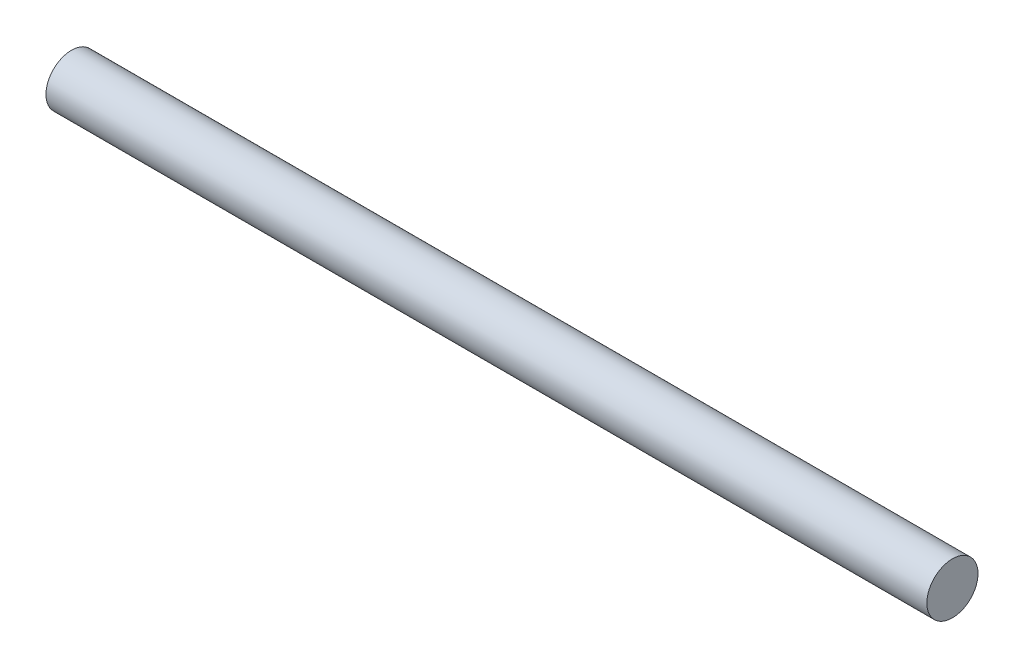
ISO-10303-21;
HEADER;
FILE_DESCRIPTION(('STEP AP214'),'2;1');
FILE_NAME('part.step','',(''),(''),'','','');
FILE_SCHEMA(('AUTOMOTIVE_DESIGN { 1 0 10303 214 1 1 1 1 }'));
ENDSEC;
DATA;
#1=APPLICATION_CONTEXT('core data for automotive mechanical design processes');
#2=APPLICATION_PROTOCOL_DEFINITION('international standard','automotive_design',2000,#1);
#3=PRODUCT_CONTEXT('',#1,'mechanical');
#4=PRODUCT('Part','Part','',(#3));
#5=PRODUCT_RELATED_PRODUCT_CATEGORY('part','',(#4));
#6=PRODUCT_DEFINITION_FORMATION('','',#4);
#7=PRODUCT_DEFINITION_CONTEXT('part definition',#1,'design');
#8=PRODUCT_DEFINITION('design','',#6,#7);
#9=PRODUCT_DEFINITION_SHAPE('','',#8);
#10=(LENGTH_UNIT() NAMED_UNIT(*) SI_UNIT(.MILLI.,.METRE.));
#11=(NAMED_UNIT(*) PLANE_ANGLE_UNIT() SI_UNIT($,.RADIAN.));
#12=(NAMED_UNIT(*) SI_UNIT($,.STERADIAN.) SOLID_ANGLE_UNIT());
#13=UNCERTAINTY_MEASURE_WITH_UNIT(LENGTH_MEASURE(1.E-05),#10,'distance_accuracy_value','');
#14=(GEOMETRIC_REPRESENTATION_CONTEXT(3) GLOBAL_UNCERTAINTY_ASSIGNED_CONTEXT((#13)) GLOBAL_UNIT_ASSIGNED_CONTEXT((#10,
#11,#12)) REPRESENTATION_CONTEXT('',''));
#15=CARTESIAN_POINT('',(0.,0.,0.));
#16=DIRECTION('',(0.,0.,1.));
#17=DIRECTION('',(1.,0.,0.));
#18=AXIS2_PLACEMENT_3D('',#15,#16,#17);
#19=CARTESIAN_POINT('',(620.,0.,0.));
#20=DIRECTION('',(-1.,0.,0.));
#21=DIRECTION('',(0.,0.,1.));
#22=AXIS2_PLACEMENT_3D('',#19,#20,#21);
#23=CYLINDRICAL_SURFACE('',#22,18.);
#24=CARTESIAN_POINT('',(620.,0.,0.));
#25=DIRECTION('',(1.,0.,0.));
#26=DIRECTION('',(0.,0.,-1.));
#27=AXIS2_PLACEMENT_3D('',#24,#25,#26);
#28=CIRCLE('',#27,18.);
#29=CARTESIAN_POINT('',(620.,0.,-18.));
#30=VERTEX_POINT('',#29);
#31=EDGE_CURVE('E12',#30,#30,#28,.T.);
#32=ORIENTED_EDGE('',*,*,#31,.F.);
#33=EDGE_LOOP('',(#32));
#34=FACE_BOUND('',#33,.T.);
#35=CARTESIAN_POINT('',(0.,0.,0.));
#36=DIRECTION('',(1.,0.,0.));
#37=DIRECTION('',(0.,0.,-1.));
#38=AXIS2_PLACEMENT_3D('',#35,#36,#37);
#39=CIRCLE('',#38,18.);
#40=CARTESIAN_POINT('',(0.,0.,-18.));
#41=VERTEX_POINT('',#40);
#42=EDGE_CURVE('E49',#41,#41,#39,.T.);
#43=ORIENTED_EDGE('',*,*,#42,.T.);
#44=EDGE_LOOP('',(#43));
#45=FACE_BOUND('',#44,.T.);
#46=ADVANCED_FACE('F46',(#34,#45),#23,.T.);
#47=CARTESIAN_POINT('',(620.,0.,0.));
#48=DIRECTION('',(1.,0.,0.));
#49=DIRECTION('',(0.,0.,-1.));
#50=AXIS2_PLACEMENT_3D('',#47,#48,#49);
#51=PLANE('',#50);
#52=ORIENTED_EDGE('',*,*,#31,.T.);
#53=EDGE_LOOP('',(#52));
#54=FACE_BOUND('',#53,.T.);
#55=ADVANCED_FACE('F61',(#54),#51,.T.);
#56=CARTESIAN_POINT('',(0.,0.,0.));
#57=DIRECTION('',(1.,0.,0.));
#58=DIRECTION('',(0.,0.,-1.));
#59=AXIS2_PLACEMENT_3D('',#56,#57,#58);
#60=PLANE('',#59);
#61=ORIENTED_EDGE('',*,*,#42,.F.);
#62=EDGE_LOOP('',(#61));
#63=FACE_BOUND('',#62,.T.);
#64=ADVANCED_FACE('F59',(#63),#60,.F.);
#65=CLOSED_SHELL('',(#46,#55,#64));
#66=MANIFOLD_SOLID_BREP('B2',#65);
#67=ADVANCED_BREP_SHAPE_REPRESENTATION('',(#18,#66),#14);
#68=SHAPE_DEFINITION_REPRESENTATION(#9,#67);
ENDSEC;
END-ISO-10303-21;
